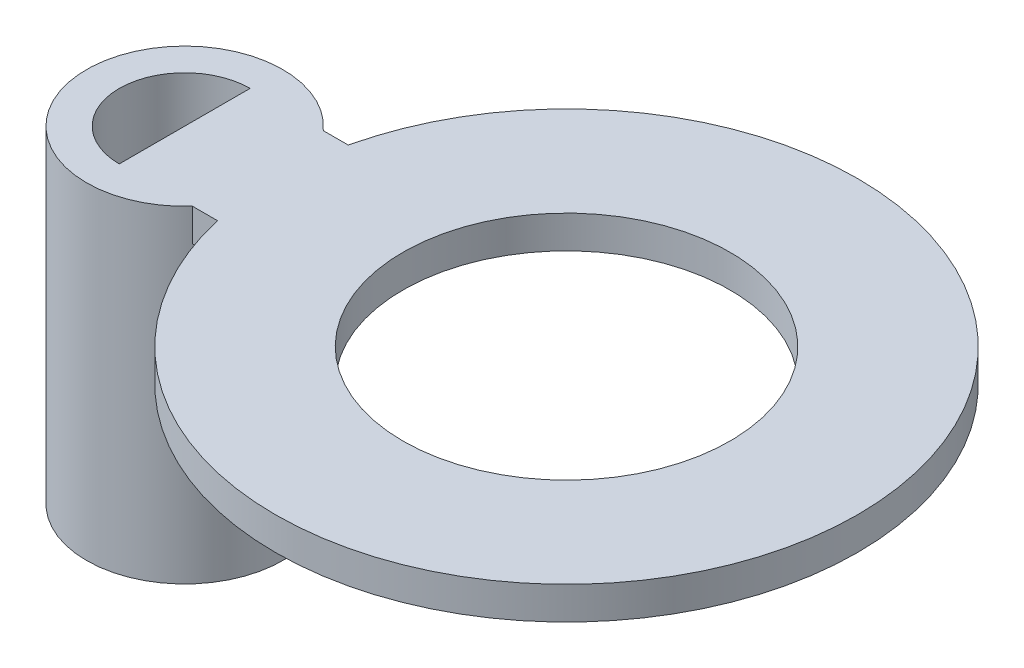
ISO-10303-21;
HEADER;
FILE_DESCRIPTION(('STEP AP214'),'2;1');
FILE_NAME('part.step','',(''),(''),'','','');
FILE_SCHEMA(('AUTOMOTIVE_DESIGN { 1 0 10303 214 1 1 1 1 }'));
ENDSEC;
DATA;
#1=APPLICATION_CONTEXT('core data for automotive mechanical design processes');
#2=APPLICATION_PROTOCOL_DEFINITION('international standard','automotive_design',2000,#1);
#3=PRODUCT_CONTEXT('',#1,'mechanical');
#4=PRODUCT('Part','Part','',(#3));
#5=PRODUCT_RELATED_PRODUCT_CATEGORY('part','',(#4));
#6=PRODUCT_DEFINITION_FORMATION('','',#4);
#7=PRODUCT_DEFINITION_CONTEXT('part definition',#1,'design');
#8=PRODUCT_DEFINITION('design','',#6,#7);
#9=PRODUCT_DEFINITION_SHAPE('','',#8);
#10=(LENGTH_UNIT() NAMED_UNIT(*) SI_UNIT(.MILLI.,.METRE.));
#11=(NAMED_UNIT(*) PLANE_ANGLE_UNIT() SI_UNIT($,.RADIAN.));
#12=(NAMED_UNIT(*) SI_UNIT($,.STERADIAN.) SOLID_ANGLE_UNIT());
#13=UNCERTAINTY_MEASURE_WITH_UNIT(LENGTH_MEASURE(1.E-05),#10,'distance_accuracy_value','');
#14=(GEOMETRIC_REPRESENTATION_CONTEXT(3) GLOBAL_UNCERTAINTY_ASSIGNED_CONTEXT((#13)) GLOBAL_UNIT_ASSIGNED_CONTEXT((#10,
#11,#12)) REPRESENTATION_CONTEXT('',''));
#15=CARTESIAN_POINT('',(0.,0.,0.));
#16=DIRECTION('',(0.,0.,1.));
#17=DIRECTION('',(1.,0.,0.));
#18=AXIS2_PLACEMENT_3D('',#15,#16,#17);
#19=CARTESIAN_POINT('',(5.83618495915476,0.,0.));
#20=DIRECTION('',(0.,1.,0.));
#21=DIRECTION('',(0.,0.,1.));
#22=AXIS2_PLACEMENT_3D('',#19,#20,#21);
#23=PLANE('',#22);
#24=CARTESIAN_POINT('',(0.,0.,0.));
#25=DIRECTION('',(0.,1.,0.));
#26=DIRECTION('',(0.,0.,1.));
#27=AXIS2_PLACEMENT_3D('',#24,#25,#26);
#28=CIRCLE('',#27,1.);
#29=CARTESIAN_POINT('',(0.,0.,1.));
#30=VERTEX_POINT('',#29);
#31=CARTESIAN_POINT('',(0.,0.,-1.));
#32=VERTEX_POINT('',#31);
#33=EDGE_CURVE('E95',#30,#32,#28,.T.);
#34=ORIENTED_EDGE('',*,*,#33,.F.);
#35=DIRECTION('',(0.,0.,1.));
#36=VECTOR('',#35,1.);
#37=CARTESIAN_POINT('',(0.,0.,1.));
#38=LINE('',#37,#36);
#39=EDGE_CURVE('E83',#32,#30,#38,.T.);
#40=ORIENTED_EDGE('',*,*,#39,.F.);
#41=EDGE_LOOP('',(#34,#40));
#42=FACE_BOUND('',#41,.T.);
#43=ADVANCED_FACE('F33',(#42),#23,.F.);
#44=CARTESIAN_POINT('',(5.83618495915476,0.5,0.));
#45=DIRECTION('',(0.,1.,0.));
#46=DIRECTION('',(0.,0.,1.));
#47=AXIS2_PLACEMENT_3D('',#44,#45,#46);
#48=PLANE('',#47);
#49=DIRECTION('',(-1.,0.,0.));
#50=VECTOR('',#49,1.);
#51=CARTESIAN_POINT('',(0.,0.5,-1.));
#52=LINE('',#51,#50);
#53=CARTESIAN_POINT('',(1.5,0.5,-1.));
#54=VERTEX_POINT('',#53);
#55=CARTESIAN_POINT('',(1.1180339887499,0.5,-1.));
#56=VERTEX_POINT('',#55);
#57=EDGE_CURVE('E107',#54,#56,#52,.T.);
#58=ORIENTED_EDGE('',*,*,#57,.T.);
#59=CARTESIAN_POINT('',(0.,0.5,0.));
#60=DIRECTION('',(0.,1.,0.));
#61=DIRECTION('',(0.,0.,1.));
#62=AXIS2_PLACEMENT_3D('',#59,#60,#61);
#63=CIRCLE('',#62,1.5);
#64=CARTESIAN_POINT('',(1.1180339887499,0.5,1.));
#65=VERTEX_POINT('',#64);
#66=EDGE_CURVE('E142',#56,#65,#63,.T.);
#67=ORIENTED_EDGE('',*,*,#66,.T.);
#68=DIRECTION('',(1.,0.,0.));
#69=VECTOR('',#68,1.);
#70=CARTESIAN_POINT('',(0.,0.5,1.));
#71=LINE('',#70,#69);
#72=CARTESIAN_POINT('',(1.5,0.5,0.999999999999999));
#73=VERTEX_POINT('',#72);
#74=EDGE_CURVE('E48',#65,#73,#71,.T.);
#75=ORIENTED_EDGE('',*,*,#74,.T.);
#76=CARTESIAN_POINT('',(5.83618495915476,0.5,0.));
#77=DIRECTION('',(0.,1.,0.));
#78=DIRECTION('',(0.,0.,1.));
#79=AXIS2_PLACEMENT_3D('',#76,#77,#78);
#80=CIRCLE('',#79,4.45);
#81=EDGE_CURVE('E119',#73,#54,#80,.T.);
#82=ORIENTED_EDGE('',*,*,#81,.T.);
#83=EDGE_LOOP('',(#58,#67,#75,#82));
#84=FACE_BOUND('',#83,.T.);
#85=CARTESIAN_POINT('',(5.83618495915476,0.5,0.));
#86=DIRECTION('',(0.,1.,0.));
#87=DIRECTION('',(0.,0.,1.));
#88=AXIS2_PLACEMENT_3D('',#85,#86,#87);
#89=CIRCLE('',#88,2.5);
#90=CARTESIAN_POINT('',(5.83618495915476,0.5,2.5));
#91=VERTEX_POINT('',#90);
#92=EDGE_CURVE('E123',#91,#91,#89,.T.);
#93=ORIENTED_EDGE('',*,*,#92,.F.);
#94=EDGE_LOOP('',(#93));
#95=FACE_BOUND('',#94,.T.);
#96=DIRECTION('',(0.,0.,1.));
#97=VECTOR('',#96,1.);
#98=CARTESIAN_POINT('',(0.,0.5,1.));
#99=LINE('',#98,#97);
#100=CARTESIAN_POINT('',(0.,0.5,-1.));
#101=VERTEX_POINT('',#100);
#102=CARTESIAN_POINT('',(0.,0.5,1.));
#103=VERTEX_POINT('',#102);
#104=EDGE_CURVE('E103',#101,#103,#99,.T.);
#105=ORIENTED_EDGE('',*,*,#104,.T.);
#106=CARTESIAN_POINT('',(0.,0.5,0.));
#107=DIRECTION('',(0.,1.,0.));
#108=DIRECTION('',(0.,0.,1.));
#109=AXIS2_PLACEMENT_3D('',#106,#107,#108);
#110=CIRCLE('',#109,1.);
#111=EDGE_CURVE('E102',#101,#103,#110,.T.);
#112=ORIENTED_EDGE('',*,*,#111,.F.);
#113=EDGE_LOOP('',(#105,#112));
#114=FACE_BOUND('',#113,.T.);
#115=ADVANCED_FACE('F167',(#84,#95,#114),#48,.T.);
#116=DIRECTION('',(1.,0.,0.));
#117=VECTOR('',#116,1.);
#118=CARTESIAN_POINT('',(0.,0.,1.));
#119=LINE('',#118,#117);
#120=CARTESIAN_POINT('',(1.1180339887499,0.,1.));
#121=VERTEX_POINT('',#120);
#122=CARTESIAN_POINT('',(1.5,0.,0.999999999999999));
#123=VERTEX_POINT('',#122);
#124=EDGE_CURVE('E120',#121,#123,#119,.T.);
#125=ORIENTED_EDGE('',*,*,#124,.F.);
#126=CARTESIAN_POINT('',(0.,0.,0.));
#127=DIRECTION('',(0.,1.,0.));
#128=DIRECTION('',(0.,0.,1.));
#129=AXIS2_PLACEMENT_3D('',#126,#127,#128);
#130=CIRCLE('',#129,1.5);
#131=CARTESIAN_POINT('',(1.1180339887499,0.,-1.));
#132=VERTEX_POINT('',#131);
#133=EDGE_CURVE('E97',#121,#132,#130,.T.);
#134=ORIENTED_EDGE('',*,*,#133,.T.);
#135=DIRECTION('',(-1.,0.,0.));
#136=VECTOR('',#135,1.);
#137=CARTESIAN_POINT('',(0.,0.,-1.));
#138=LINE('',#137,#136);
#139=CARTESIAN_POINT('',(1.5,0.,-1.));
#140=VERTEX_POINT('',#139);
#141=EDGE_CURVE('E93',#140,#132,#138,.T.);
#142=ORIENTED_EDGE('',*,*,#141,.F.);
#143=CARTESIAN_POINT('',(5.83618495915476,0.,0.));
#144=DIRECTION('',(0.,1.,0.));
#145=DIRECTION('',(0.,0.,1.));
#146=AXIS2_PLACEMENT_3D('',#143,#144,#145);
#147=CIRCLE('',#146,4.45);
#148=EDGE_CURVE('E118',#123,#140,#147,.T.);
#149=ORIENTED_EDGE('',*,*,#148,.F.);
#150=EDGE_LOOP('',(#125,#134,#142,#149));
#151=FACE_BOUND('',#150,.T.);
#152=CARTESIAN_POINT('',(5.83618495915476,0.,0.));
#153=DIRECTION('',(0.,1.,0.));
#154=DIRECTION('',(0.,0.,1.));
#155=AXIS2_PLACEMENT_3D('',#152,#153,#154);
#156=CIRCLE('',#155,2.5);
#157=CARTESIAN_POINT('',(5.83618495915476,0.,2.5));
#158=VERTEX_POINT('',#157);
#159=EDGE_CURVE('E135',#158,#158,#156,.T.);
#160=ORIENTED_EDGE('',*,*,#159,.T.);
#161=EDGE_LOOP('',(#160));
#162=FACE_BOUND('',#161,.T.);
#163=ADVANCED_FACE('F126',(#151,#162),#23,.F.);
#164=CARTESIAN_POINT('',(0.,0.5,1.));
#165=DIRECTION('',(0.,0.,-1.));
#166=DIRECTION('',(-1.,0.,0.));
#167=AXIS2_PLACEMENT_3D('',#164,#165,#166);
#168=PLANE('',#167);
#169=ORIENTED_EDGE('',*,*,#74,.F.);
#170=DIRECTION('',(0.,1.,0.));
#171=VECTOR('',#170,1.);
#172=CARTESIAN_POINT('',(1.1180339887499,-4.5,1.));
#173=LINE('',#172,#171);
#174=EDGE_CURVE('E52',#65,#121,#173,.F.);
#175=ORIENTED_EDGE('',*,*,#174,.T.);
#176=ORIENTED_EDGE('',*,*,#124,.T.);
#177=DIRECTION('',(0.,-1.,0.));
#178=VECTOR('',#177,1.);
#179=CARTESIAN_POINT('',(1.5,0.5,0.999999999999999));
#180=LINE('',#179,#178);
#181=EDGE_CURVE('E41',#73,#123,#180,.T.);
#182=ORIENTED_EDGE('',*,*,#181,.F.);
#183=EDGE_LOOP('',(#169,#175,#176,#182));
#184=FACE_BOUND('',#183,.T.);
#185=ADVANCED_FACE('F35',(#184),#168,.F.);
#186=CARTESIAN_POINT('',(5.83618495915476,0.5,0.));
#187=DIRECTION('',(0.,-1.,0.));
#188=DIRECTION('',(0.,0.,-1.));
#189=AXIS2_PLACEMENT_3D('',#186,#187,#188);
#190=CYLINDRICAL_SURFACE('',#189,4.45);
#191=ORIENTED_EDGE('',*,*,#148,.T.);
#192=DIRECTION('',(0.,-1.,0.));
#193=VECTOR('',#192,1.);
#194=CARTESIAN_POINT('',(1.5,0.5,-1.));
#195=LINE('',#194,#193);
#196=EDGE_CURVE('E105',#54,#140,#195,.T.);
#197=ORIENTED_EDGE('',*,*,#196,.F.);
#198=ORIENTED_EDGE('',*,*,#81,.F.);
#199=ORIENTED_EDGE('',*,*,#181,.T.);
#200=EDGE_LOOP('',(#191,#197,#198,#199));
#201=FACE_BOUND('',#200,.T.);
#202=ADVANCED_FACE('F115',(#201),#190,.T.);
#203=CARTESIAN_POINT('',(0.,0.5,-1.));
#204=DIRECTION('',(0.,0.,1.));
#205=DIRECTION('',(1.,0.,0.));
#206=AXIS2_PLACEMENT_3D('',#203,#204,#205);
#207=PLANE('',#206);
#208=ORIENTED_EDGE('',*,*,#141,.T.);
#209=DIRECTION('',(0.,1.,0.));
#210=VECTOR('',#209,1.);
#211=CARTESIAN_POINT('',(1.1180339887499,-4.5,-1.));
#212=LINE('',#211,#210);
#213=EDGE_CURVE('E11',#132,#56,#212,.T.);
#214=ORIENTED_EDGE('',*,*,#213,.T.);
#215=ORIENTED_EDGE('',*,*,#57,.F.);
#216=ORIENTED_EDGE('',*,*,#196,.T.);
#217=EDGE_LOOP('',(#208,#214,#215,#216));
#218=FACE_BOUND('',#217,.T.);
#219=ADVANCED_FACE('F182',(#218),#207,.F.);
#220=CARTESIAN_POINT('',(0.,0.5,1.));
#221=DIRECTION('',(1.,0.,0.));
#222=DIRECTION('',(0.,0.,-1.));
#223=AXIS2_PLACEMENT_3D('',#220,#221,#222);
#224=PLANE('',#223);
#225=ORIENTED_EDGE('',*,*,#39,.T.);
#226=DIRECTION('',(0.,-1.,0.));
#227=VECTOR('',#226,1.);
#228=CARTESIAN_POINT('',(0.,0.5,1.));
#229=LINE('',#228,#227);
#230=EDGE_CURVE('E87',#103,#30,#229,.T.);
#231=ORIENTED_EDGE('',*,*,#230,.F.);
#232=ORIENTED_EDGE('',*,*,#104,.F.);
#233=DIRECTION('',(0.,-1.,0.));
#234=VECTOR('',#233,1.);
#235=CARTESIAN_POINT('',(0.,0.5,-1.));
#236=LINE('',#235,#234);
#237=EDGE_CURVE('E90',#101,#32,#236,.T.);
#238=ORIENTED_EDGE('',*,*,#237,.T.);
#239=EDGE_LOOP('',(#225,#231,#232,#238));
#240=FACE_BOUND('',#239,.T.);
#241=ADVANCED_FACE('F85',(#240),#224,.F.);
#242=CARTESIAN_POINT('',(5.83618495915476,0.5,0.));
#243=DIRECTION('',(0.,-1.,0.));
#244=DIRECTION('',(0.,0.,-1.));
#245=AXIS2_PLACEMENT_3D('',#242,#243,#244);
#246=CYLINDRICAL_SURFACE('',#245,2.5);
#247=ORIENTED_EDGE('',*,*,#92,.T.);
#248=EDGE_LOOP('',(#247));
#249=FACE_BOUND('',#248,.T.);
#250=ORIENTED_EDGE('',*,*,#159,.F.);
#251=EDGE_LOOP('',(#250));
#252=FACE_BOUND('',#251,.T.);
#253=ADVANCED_FACE('F163',(#249,#252),#246,.F.);
#254=CARTESIAN_POINT('',(0.,-4.5,0.));
#255=DIRECTION('',(0.,1.,0.));
#256=DIRECTION('',(0.,0.,1.));
#257=AXIS2_PLACEMENT_3D('',#254,#255,#256);
#258=CYLINDRICAL_SURFACE('',#257,1.5);
#259=CARTESIAN_POINT('',(0.,-4.5,0.));
#260=DIRECTION('',(0.,1.,0.));
#261=DIRECTION('',(0.,0.,1.));
#262=AXIS2_PLACEMENT_3D('',#259,#260,#261);
#263=CIRCLE('',#262,1.5);
#264=CARTESIAN_POINT('',(0.,-4.5,1.5));
#265=VERTEX_POINT('',#264);
#266=EDGE_CURVE('E98',#265,#265,#263,.T.);
#267=ORIENTED_EDGE('',*,*,#266,.T.);
#268=EDGE_LOOP('',(#267));
#269=FACE_BOUND('',#268,.T.);
#270=ORIENTED_EDGE('',*,*,#174,.F.);
#271=ORIENTED_EDGE('',*,*,#66,.F.);
#272=ORIENTED_EDGE('',*,*,#213,.F.);
#273=ORIENTED_EDGE('',*,*,#133,.F.);
#274=EDGE_LOOP('',(#270,#271,#272,#273));
#275=FACE_BOUND('',#274,.T.);
#276=ADVANCED_FACE('F156',(#269,#275),#258,.T.);
#277=CARTESIAN_POINT('',(0.,-4.5,0.));
#278=DIRECTION('',(0.,1.,0.));
#279=DIRECTION('',(0.,0.,1.));
#280=AXIS2_PLACEMENT_3D('',#277,#278,#279);
#281=CYLINDRICAL_SURFACE('',#280,1.);
#282=CARTESIAN_POINT('',(0.,-4.5,0.));
#283=DIRECTION('',(0.,1.,0.));
#284=DIRECTION('',(0.,0.,1.));
#285=AXIS2_PLACEMENT_3D('',#282,#283,#284);
#286=CIRCLE('',#285,1.);
#287=CARTESIAN_POINT('',(0.,-4.5,1.));
#288=VERTEX_POINT('',#287);
#289=EDGE_CURVE('E145',#288,#288,#286,.T.);
#290=ORIENTED_EDGE('',*,*,#289,.F.);
#291=EDGE_LOOP('',(#290));
#292=FACE_BOUND('',#291,.T.);
#293=ORIENTED_EDGE('',*,*,#33,.T.);
#294=ORIENTED_EDGE('',*,*,#237,.F.);
#295=ORIENTED_EDGE('',*,*,#111,.T.);
#296=ORIENTED_EDGE('',*,*,#230,.T.);
#297=EDGE_LOOP('',(#293,#294,#295,#296));
#298=FACE_BOUND('',#297,.T.);
#299=ADVANCED_FACE('F100',(#292,#298),#281,.F.);
#300=CARTESIAN_POINT('',(0.,-4.5,0.));
#301=DIRECTION('',(0.,1.,0.));
#302=DIRECTION('',(0.,0.,1.));
#303=AXIS2_PLACEMENT_3D('',#300,#301,#302);
#304=PLANE('',#303);
#305=ORIENTED_EDGE('',*,*,#289,.T.);
#306=EDGE_LOOP('',(#305));
#307=FACE_BOUND('',#306,.T.);
#308=ORIENTED_EDGE('',*,*,#266,.F.);
#309=EDGE_LOOP('',(#308));
#310=FACE_BOUND('',#309,.T.);
#311=ADVANCED_FACE('F152',(#307,#310),#304,.F.);
#312=CLOSED_SHELL('',(#43,#115,#163,#185,#202,#219,#241,#253,#276,#299,#311));
#313=MANIFOLD_SOLID_BREP('B2',#312);
#314=ADVANCED_BREP_SHAPE_REPRESENTATION('',(#18,#313),#14);
#315=SHAPE_DEFINITION_REPRESENTATION(#9,#314);
ENDSEC;
END-ISO-10303-21;
